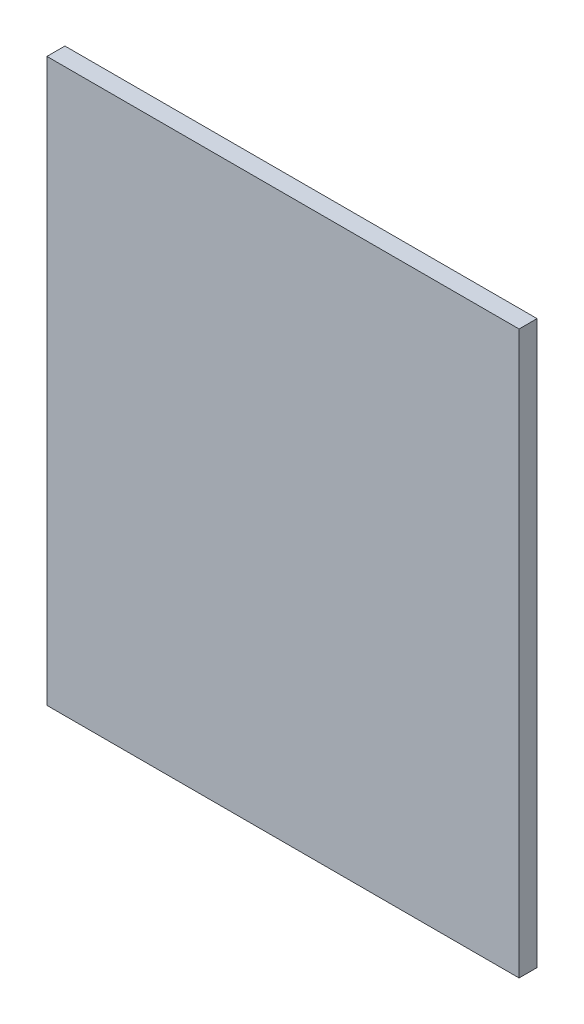
ISO-10303-21;
HEADER;
FILE_DESCRIPTION(('STEP AP214'),'2;1');
FILE_NAME('part.step','',(''),(''),'','','');
FILE_SCHEMA(('AUTOMOTIVE_DESIGN { 1 0 10303 214 1 1 1 1 }'));
ENDSEC;
DATA;
#1=APPLICATION_CONTEXT('core data for automotive mechanical design processes');
#2=APPLICATION_PROTOCOL_DEFINITION('international standard','automotive_design',2000,#1);
#3=PRODUCT_CONTEXT('',#1,'mechanical');
#4=PRODUCT('Part','Part','',(#3));
#5=PRODUCT_RELATED_PRODUCT_CATEGORY('part','',(#4));
#6=PRODUCT_DEFINITION_FORMATION('','',#4);
#7=PRODUCT_DEFINITION_CONTEXT('part definition',#1,'design');
#8=PRODUCT_DEFINITION('design','',#6,#7);
#9=PRODUCT_DEFINITION_SHAPE('','',#8);
#10=(LENGTH_UNIT() NAMED_UNIT(*) SI_UNIT(.MILLI.,.METRE.));
#11=(NAMED_UNIT(*) PLANE_ANGLE_UNIT() SI_UNIT($,.RADIAN.));
#12=(NAMED_UNIT(*) SI_UNIT($,.STERADIAN.) SOLID_ANGLE_UNIT());
#13=UNCERTAINTY_MEASURE_WITH_UNIT(LENGTH_MEASURE(1.E-05),#10,'distance_accuracy_value','');
#14=(GEOMETRIC_REPRESENTATION_CONTEXT(3) GLOBAL_UNCERTAINTY_ASSIGNED_CONTEXT((#13)) GLOBAL_UNIT_ASSIGNED_CONTEXT((#10,
#11,#12)) REPRESENTATION_CONTEXT('',''));
#15=CARTESIAN_POINT('',(0.,0.,0.));
#16=DIRECTION('',(0.,0.,1.));
#17=DIRECTION('',(1.,0.,0.));
#18=AXIS2_PLACEMENT_3D('',#15,#16,#17);
#19=CARTESIAN_POINT('',(-21.,-25.,1.6));
#20=DIRECTION('',(1.,0.,0.));
#21=DIRECTION('',(0.,0.,-1.));
#22=AXIS2_PLACEMENT_3D('',#19,#20,#21);
#23=PLANE('',#22);
#24=DIRECTION('',(0.,-1.,0.));
#25=VECTOR('',#24,1.);
#26=CARTESIAN_POINT('',(-21.,-25.,0.));
#27=LINE('',#26,#25);
#28=CARTESIAN_POINT('',(-21.,25.,0.));
#29=VERTEX_POINT('',#28);
#30=CARTESIAN_POINT('',(-21.,-25.,0.));
#31=VERTEX_POINT('',#30);
#32=EDGE_CURVE('E97',#29,#31,#27,.T.);
#33=ORIENTED_EDGE('',*,*,#32,.T.);
#34=DIRECTION('',(0.,0.,-1.));
#35=VECTOR('',#34,1.);
#36=CARTESIAN_POINT('',(-21.,-25.,1.6));
#37=LINE('',#36,#35);
#38=CARTESIAN_POINT('',(-21.,-25.,1.6));
#39=VERTEX_POINT('',#38);
#40=EDGE_CURVE('E11',#39,#31,#37,.T.);
#41=ORIENTED_EDGE('',*,*,#40,.F.);
#42=DIRECTION('',(0.,-1.,0.));
#43=VECTOR('',#42,1.);
#44=CARTESIAN_POINT('',(-21.,-25.,1.6));
#45=LINE('',#44,#43);
#46=CARTESIAN_POINT('',(-21.,25.,1.6));
#47=VERTEX_POINT('',#46);
#48=EDGE_CURVE('E85',#47,#39,#45,.T.);
#49=ORIENTED_EDGE('',*,*,#48,.F.);
#50=DIRECTION('',(0.,0.,-1.));
#51=VECTOR('',#50,1.);
#52=CARTESIAN_POINT('',(-21.,25.,1.6));
#53=LINE('',#52,#51);
#54=EDGE_CURVE('E93',#47,#29,#53,.T.);
#55=ORIENTED_EDGE('',*,*,#54,.T.);
#56=EDGE_LOOP('',(#33,#41,#49,#55));
#57=FACE_BOUND('',#56,.T.);
#58=ADVANCED_FACE('F34',(#57),#23,.F.);
#59=CARTESIAN_POINT('',(21.,-25.,1.6));
#60=DIRECTION('',(0.,1.,0.));
#61=DIRECTION('',(-1.,0.,0.));
#62=AXIS2_PLACEMENT_3D('',#59,#60,#61);
#63=PLANE('',#62);
#64=DIRECTION('',(1.,0.,0.));
#65=VECTOR('',#64,1.);
#66=CARTESIAN_POINT('',(21.,-25.,0.));
#67=LINE('',#66,#65);
#68=CARTESIAN_POINT('',(21.,-25.,0.));
#69=VERTEX_POINT('',#68);
#70=EDGE_CURVE('E89',#31,#69,#67,.T.);
#71=ORIENTED_EDGE('',*,*,#70,.T.);
#72=DIRECTION('',(0.,0.,-1.));
#73=VECTOR('',#72,1.);
#74=CARTESIAN_POINT('',(21.,-25.,1.6));
#75=LINE('',#74,#73);
#76=CARTESIAN_POINT('',(21.,-25.,1.6));
#77=VERTEX_POINT('',#76);
#78=EDGE_CURVE('E42',#77,#69,#75,.T.);
#79=ORIENTED_EDGE('',*,*,#78,.F.);
#80=DIRECTION('',(1.,0.,0.));
#81=VECTOR('',#80,1.);
#82=CARTESIAN_POINT('',(21.,-25.,1.6));
#83=LINE('',#82,#81);
#84=EDGE_CURVE('E80',#39,#77,#83,.T.);
#85=ORIENTED_EDGE('',*,*,#84,.F.);
#86=ORIENTED_EDGE('',*,*,#40,.T.);
#87=EDGE_LOOP('',(#71,#79,#85,#86));
#88=FACE_BOUND('',#87,.T.);
#89=ADVANCED_FACE('F88',(#88),#63,.F.);
#90=CARTESIAN_POINT('',(21.,-25.,1.6));
#91=DIRECTION('',(-1.,0.,0.));
#92=DIRECTION('',(0.,0.,1.));
#93=AXIS2_PLACEMENT_3D('',#90,#91,#92);
#94=PLANE('',#93);
#95=DIRECTION('',(0.,1.,0.));
#96=VECTOR('',#95,1.);
#97=CARTESIAN_POINT('',(21.,-25.,0.));
#98=LINE('',#97,#96);
#99=CARTESIAN_POINT('',(21.,25.,0.));
#100=VERTEX_POINT('',#99);
#101=EDGE_CURVE('E67',#69,#100,#98,.T.);
#102=ORIENTED_EDGE('',*,*,#101,.T.);
#103=DIRECTION('',(0.,0.,-1.));
#104=VECTOR('',#103,1.);
#105=CARTESIAN_POINT('',(21.,25.,1.6));
#106=LINE('',#105,#104);
#107=CARTESIAN_POINT('',(21.,25.,1.6));
#108=VERTEX_POINT('',#107);
#109=EDGE_CURVE('E90',#108,#100,#106,.T.);
#110=ORIENTED_EDGE('',*,*,#109,.F.);
#111=DIRECTION('',(0.,1.,0.));
#112=VECTOR('',#111,1.);
#113=CARTESIAN_POINT('',(21.,-25.,1.6));
#114=LINE('',#113,#112);
#115=EDGE_CURVE('E83',#77,#108,#114,.T.);
#116=ORIENTED_EDGE('',*,*,#115,.F.);
#117=ORIENTED_EDGE('',*,*,#78,.T.);
#118=EDGE_LOOP('',(#102,#110,#116,#117));
#119=FACE_BOUND('',#118,.T.);
#120=ADVANCED_FACE('F91',(#119),#94,.F.);
#121=CARTESIAN_POINT('',(21.,25.,1.6));
#122=DIRECTION('',(0.,-1.,0.));
#123=DIRECTION('',(1.,0.,0.));
#124=AXIS2_PLACEMENT_3D('',#121,#122,#123);
#125=PLANE('',#124);
#126=DIRECTION('',(-1.,0.,0.));
#127=VECTOR('',#126,1.);
#128=CARTESIAN_POINT('',(21.,25.,0.));
#129=LINE('',#128,#127);
#130=EDGE_CURVE('E73',#100,#29,#129,.T.);
#131=ORIENTED_EDGE('',*,*,#130,.T.);
#132=ORIENTED_EDGE('',*,*,#54,.F.);
#133=DIRECTION('',(-1.,0.,0.));
#134=VECTOR('',#133,1.);
#135=CARTESIAN_POINT('',(21.,25.,1.6));
#136=LINE('',#135,#134);
#137=EDGE_CURVE('E50',#108,#47,#136,.T.);
#138=ORIENTED_EDGE('',*,*,#137,.F.);
#139=ORIENTED_EDGE('',*,*,#109,.T.);
#140=EDGE_LOOP('',(#131,#132,#138,#139));
#141=FACE_BOUND('',#140,.T.);
#142=ADVANCED_FACE('F104',(#141),#125,.F.);
#143=CARTESIAN_POINT('',(0.,0.,1.6));
#144=DIRECTION('',(0.,0.,1.));
#145=DIRECTION('',(1.,0.,0.));
#146=AXIS2_PLACEMENT_3D('',#143,#144,#145);
#147=PLANE('',#146);
#148=ORIENTED_EDGE('',*,*,#48,.T.);
#149=ORIENTED_EDGE('',*,*,#84,.T.);
#150=ORIENTED_EDGE('',*,*,#115,.T.);
#151=ORIENTED_EDGE('',*,*,#137,.T.);
#152=EDGE_LOOP('',(#148,#149,#150,#151));
#153=FACE_BOUND('',#152,.T.);
#154=ADVANCED_FACE('F81',(#153),#147,.T.);
#155=CARTESIAN_POINT('',(0.,0.,0.));
#156=DIRECTION('',(0.,0.,1.));
#157=DIRECTION('',(1.,0.,0.));
#158=AXIS2_PLACEMENT_3D('',#155,#156,#157);
#159=PLANE('',#158);
#160=ORIENTED_EDGE('',*,*,#32,.F.);
#161=ORIENTED_EDGE('',*,*,#130,.F.);
#162=ORIENTED_EDGE('',*,*,#101,.F.);
#163=ORIENTED_EDGE('',*,*,#70,.F.);
#164=EDGE_LOOP('',(#160,#161,#162,#163));
#165=FACE_BOUND('',#164,.T.);
#166=ADVANCED_FACE('F107',(#165),#159,.F.);
#167=CLOSED_SHELL('',(#58,#89,#120,#142,#154,#166));
#168=MANIFOLD_SOLID_BREP('B2',#167);
#169=ADVANCED_BREP_SHAPE_REPRESENTATION('',(#18,#168),#14);
#170=SHAPE_DEFINITION_REPRESENTATION(#9,#169);
ENDSEC;
END-ISO-10303-21;
